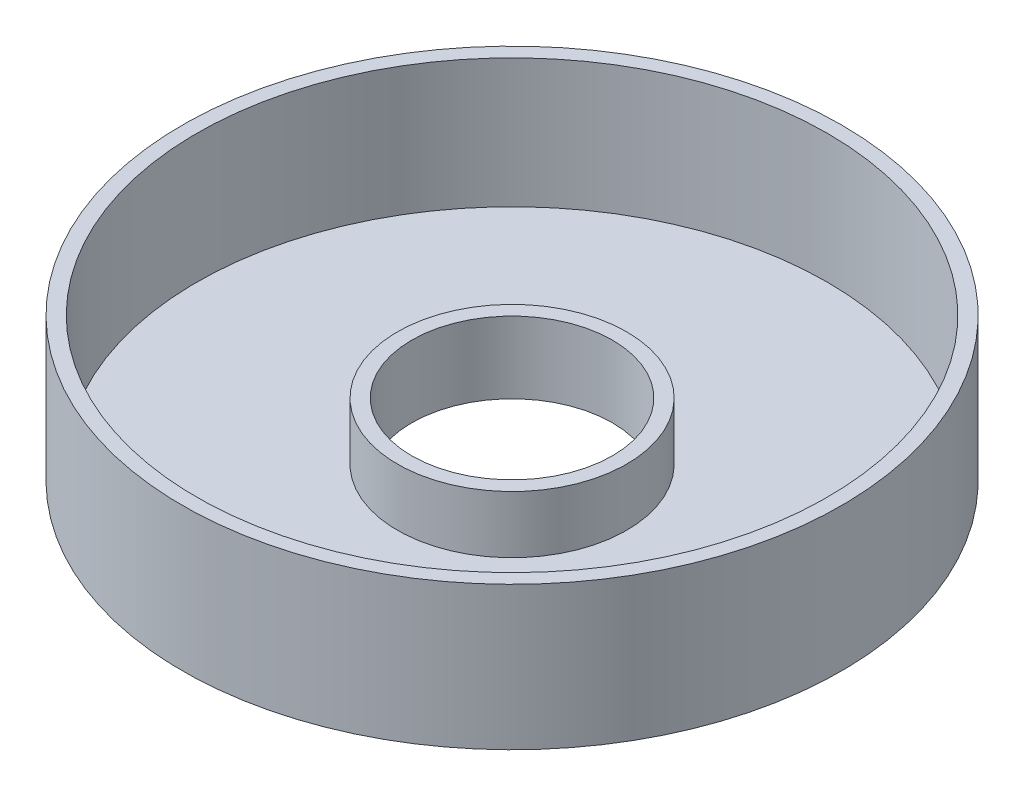
ISO-10303-21;
HEADER;
FILE_DESCRIPTION(('STEP AP214'),'2;1');
FILE_NAME('part.step','',(''),(''),'','','');
FILE_SCHEMA(('AUTOMOTIVE_DESIGN { 1 0 10303 214 1 1 1 1 }'));
ENDSEC;
DATA;
#1=APPLICATION_CONTEXT('core data for automotive mechanical design processes');
#2=APPLICATION_PROTOCOL_DEFINITION('international standard','automotive_design',2000,#1);
#3=PRODUCT_CONTEXT('',#1,'mechanical');
#4=PRODUCT('Part','Part','',(#3));
#5=PRODUCT_RELATED_PRODUCT_CATEGORY('part','',(#4));
#6=PRODUCT_DEFINITION_FORMATION('','',#4);
#7=PRODUCT_DEFINITION_CONTEXT('part definition',#1,'design');
#8=PRODUCT_DEFINITION('design','',#6,#7);
#9=PRODUCT_DEFINITION_SHAPE('','',#8);
#10=(LENGTH_UNIT() NAMED_UNIT(*) SI_UNIT(.MILLI.,.METRE.));
#11=(NAMED_UNIT(*) PLANE_ANGLE_UNIT() SI_UNIT($,.RADIAN.));
#12=(NAMED_UNIT(*) SI_UNIT($,.STERADIAN.) SOLID_ANGLE_UNIT());
#13=UNCERTAINTY_MEASURE_WITH_UNIT(LENGTH_MEASURE(1.E-05),#10,'distance_accuracy_value','');
#14=(GEOMETRIC_REPRESENTATION_CONTEXT(3) GLOBAL_UNCERTAINTY_ASSIGNED_CONTEXT((#13)) GLOBAL_UNIT_ASSIGNED_CONTEXT((#10,
#11,#12)) REPRESENTATION_CONTEXT('',''));
#15=CARTESIAN_POINT('',(0.,0.,0.));
#16=DIRECTION('',(0.,0.,1.));
#17=DIRECTION('',(1.,0.,0.));
#18=AXIS2_PLACEMENT_3D('',#15,#16,#17);
#19=CARTESIAN_POINT('',(-35.,25.,0.));
#20=DIRECTION('',(0.,-1.,0.));
#21=DIRECTION('',(0.,0.,-1.));
#22=AXIS2_PLACEMENT_3D('',#19,#20,#21);
#23=PLANE('',#22);
#24=CARTESIAN_POINT('',(0.,25.,0.));
#25=DIRECTION('',(0.,-1.,0.));
#26=DIRECTION('',(0.,0.,-1.));
#27=AXIS2_PLACEMENT_3D('',#24,#25,#26);
#28=CIRCLE('',#27,40.);
#29=CARTESIAN_POINT('',(0.,25.,-40.));
#30=VERTEX_POINT('',#29);
#31=EDGE_CURVE('E10',#30,#30,#28,.T.);
#32=ORIENTED_EDGE('',*,*,#31,.F.);
#33=EDGE_LOOP('',(#32));
#34=FACE_BOUND('',#33,.T.);
#35=CARTESIAN_POINT('',(0.,25.,0.));
#36=DIRECTION('',(0.,-1.,0.));
#37=DIRECTION('',(0.,0.,-1.));
#38=AXIS2_PLACEMENT_3D('',#35,#36,#37);
#39=CIRCLE('',#38,35.);
#40=CARTESIAN_POINT('',(0.,25.,-35.));
#41=VERTEX_POINT('',#40);
#42=EDGE_CURVE('E59',#41,#41,#39,.T.);
#43=ORIENTED_EDGE('',*,*,#42,.T.);
#44=EDGE_LOOP('',(#43));
#45=FACE_BOUND('',#44,.T.);
#46=ADVANCED_FACE('F31',(#34,#45),#23,.F.);
#47=CARTESIAN_POINT('',(0.,0.,0.));
#48=DIRECTION('',(0.,-1.,0.));
#49=DIRECTION('',(0.,0.,-1.));
#50=AXIS2_PLACEMENT_3D('',#47,#48,#49);
#51=CYLINDRICAL_SURFACE('',#50,40.);
#52=CARTESIAN_POINT('',(0.,5.,0.));
#53=DIRECTION('',(0.,-1.,0.));
#54=DIRECTION('',(0.,0.,-1.));
#55=AXIS2_PLACEMENT_3D('',#52,#53,#54);
#56=CIRCLE('',#55,40.);
#57=CARTESIAN_POINT('',(0.,5.,-40.));
#58=VERTEX_POINT('',#57);
#59=EDGE_CURVE('E37',#58,#58,#56,.T.);
#60=ORIENTED_EDGE('',*,*,#59,.F.);
#61=EDGE_LOOP('',(#60));
#62=FACE_BOUND('',#61,.T.);
#63=ORIENTED_EDGE('',*,*,#31,.T.);
#64=EDGE_LOOP('',(#63));
#65=FACE_BOUND('',#64,.T.);
#66=ADVANCED_FACE('F96',(#62,#65),#51,.T.);
#67=CARTESIAN_POINT('',(-40.,5.,0.));
#68=DIRECTION('',(0.,-1.,0.));
#69=DIRECTION('',(0.,0.,-1.));
#70=AXIS2_PLACEMENT_3D('',#67,#68,#69);
#71=PLANE('',#70);
#72=CARTESIAN_POINT('',(0.,4.99999999999999,0.));
#73=DIRECTION('',(0.,-1.,0.));
#74=DIRECTION('',(0.,0.,-1.));
#75=AXIS2_PLACEMENT_3D('',#72,#73,#74);
#76=CIRCLE('',#75,110.);
#77=CARTESIAN_POINT('',(0.,4.99999999999999,-110.));
#78=VERTEX_POINT('',#77);
#79=EDGE_CURVE('E41',#78,#78,#76,.T.);
#80=ORIENTED_EDGE('',*,*,#79,.F.);
#81=EDGE_LOOP('',(#80));
#82=FACE_BOUND('',#81,.T.);
#83=ORIENTED_EDGE('',*,*,#59,.T.);
#84=EDGE_LOOP('',(#83));
#85=FACE_BOUND('',#84,.T.);
#86=ADVANCED_FACE('F91',(#82,#85),#71,.F.);
#87=CARTESIAN_POINT('',(0.,0.,0.));
#88=DIRECTION('',(0.,-1.,0.));
#89=DIRECTION('',(0.,0.,-1.));
#90=AXIS2_PLACEMENT_3D('',#87,#88,#89);
#91=CYLINDRICAL_SURFACE('',#90,110.);
#92=CARTESIAN_POINT('',(0.,50.,0.));
#93=DIRECTION('',(0.,-1.,0.));
#94=DIRECTION('',(0.,0.,-1.));
#95=AXIS2_PLACEMENT_3D('',#92,#93,#94);
#96=CIRCLE('',#95,110.);
#97=CARTESIAN_POINT('',(0.,50.,-110.));
#98=VERTEX_POINT('',#97);
#99=EDGE_CURVE('E45',#98,#98,#96,.T.);
#100=ORIENTED_EDGE('',*,*,#99,.F.);
#101=EDGE_LOOP('',(#100));
#102=FACE_BOUND('',#101,.T.);
#103=ORIENTED_EDGE('',*,*,#79,.T.);
#104=EDGE_LOOP('',(#103));
#105=FACE_BOUND('',#104,.T.);
#106=ADVANCED_FACE('F85',(#102,#105),#91,.F.);
#107=CARTESIAN_POINT('',(-110.,50.,0.));
#108=DIRECTION('',(0.,-1.,0.));
#109=DIRECTION('',(0.,0.,-1.));
#110=AXIS2_PLACEMENT_3D('',#107,#108,#109);
#111=PLANE('',#110);
#112=CARTESIAN_POINT('',(0.,50.,0.));
#113=DIRECTION('',(0.,-1.,0.));
#114=DIRECTION('',(0.,0.,-1.));
#115=AXIS2_PLACEMENT_3D('',#112,#113,#114);
#116=CIRCLE('',#115,115.);
#117=CARTESIAN_POINT('',(0.,50.,-115.));
#118=VERTEX_POINT('',#117);
#119=EDGE_CURVE('E50',#118,#118,#116,.T.);
#120=ORIENTED_EDGE('',*,*,#119,.F.);
#121=EDGE_LOOP('',(#120));
#122=FACE_BOUND('',#121,.T.);
#123=ORIENTED_EDGE('',*,*,#99,.T.);
#124=EDGE_LOOP('',(#123));
#125=FACE_BOUND('',#124,.T.);
#126=ADVANCED_FACE('F79',(#122,#125),#111,.F.);
#127=CARTESIAN_POINT('',(0.,0.,0.));
#128=DIRECTION('',(0.,-1.,0.));
#129=DIRECTION('',(0.,0.,-1.));
#130=AXIS2_PLACEMENT_3D('',#127,#128,#129);
#131=CYLINDRICAL_SURFACE('',#130,115.);
#132=CARTESIAN_POINT('',(0.,0.,0.));
#133=DIRECTION('',(0.,-1.,0.));
#134=DIRECTION('',(0.,0.,-1.));
#135=AXIS2_PLACEMENT_3D('',#132,#133,#134);
#136=CIRCLE('',#135,115.);
#137=CARTESIAN_POINT('',(0.,0.,-115.));
#138=VERTEX_POINT('',#137);
#139=EDGE_CURVE('E53',#138,#138,#136,.T.);
#140=ORIENTED_EDGE('',*,*,#139,.F.);
#141=EDGE_LOOP('',(#140));
#142=FACE_BOUND('',#141,.T.);
#143=ORIENTED_EDGE('',*,*,#119,.T.);
#144=EDGE_LOOP('',(#143));
#145=FACE_BOUND('',#144,.T.);
#146=ADVANCED_FACE('F73',(#142,#145),#131,.T.);
#147=CARTESIAN_POINT('',(-115.,0.,0.));
#148=DIRECTION('',(0.,1.,0.));
#149=DIRECTION('',(0.,0.,1.));
#150=AXIS2_PLACEMENT_3D('',#147,#148,#149);
#151=PLANE('',#150);
#152=CARTESIAN_POINT('',(0.,0.,0.));
#153=DIRECTION('',(0.,-1.,0.));
#154=DIRECTION('',(0.,0.,-1.));
#155=AXIS2_PLACEMENT_3D('',#152,#153,#154);
#156=CIRCLE('',#155,35.);
#157=CARTESIAN_POINT('',(0.,0.,-35.));
#158=VERTEX_POINT('',#157);
#159=EDGE_CURVE('E56',#158,#158,#156,.T.);
#160=ORIENTED_EDGE('',*,*,#159,.F.);
#161=EDGE_LOOP('',(#160));
#162=FACE_BOUND('',#161,.T.);
#163=ORIENTED_EDGE('',*,*,#139,.T.);
#164=EDGE_LOOP('',(#163));
#165=FACE_BOUND('',#164,.T.);
#166=ADVANCED_FACE('F67',(#162,#165),#151,.F.);
#167=CARTESIAN_POINT('',(0.,0.,0.));
#168=DIRECTION('',(0.,-1.,0.));
#169=DIRECTION('',(0.,0.,-1.));
#170=AXIS2_PLACEMENT_3D('',#167,#168,#169);
#171=CYLINDRICAL_SURFACE('',#170,35.);
#172=ORIENTED_EDGE('',*,*,#42,.F.);
#173=EDGE_LOOP('',(#172));
#174=FACE_BOUND('',#173,.T.);
#175=ORIENTED_EDGE('',*,*,#159,.T.);
#176=EDGE_LOOP('',(#175));
#177=FACE_BOUND('',#176,.T.);
#178=ADVANCED_FACE('F64',(#174,#177),#171,.F.);
#179=CLOSED_SHELL('',(#46,#66,#86,#106,#126,#146,#166,#178));
#180=MANIFOLD_SOLID_BREP('B2',#179);
#181=ADVANCED_BREP_SHAPE_REPRESENTATION('',(#18,#180),#14);
#182=SHAPE_DEFINITION_REPRESENTATION(#9,#181);
ENDSEC;
END-ISO-10303-21;
